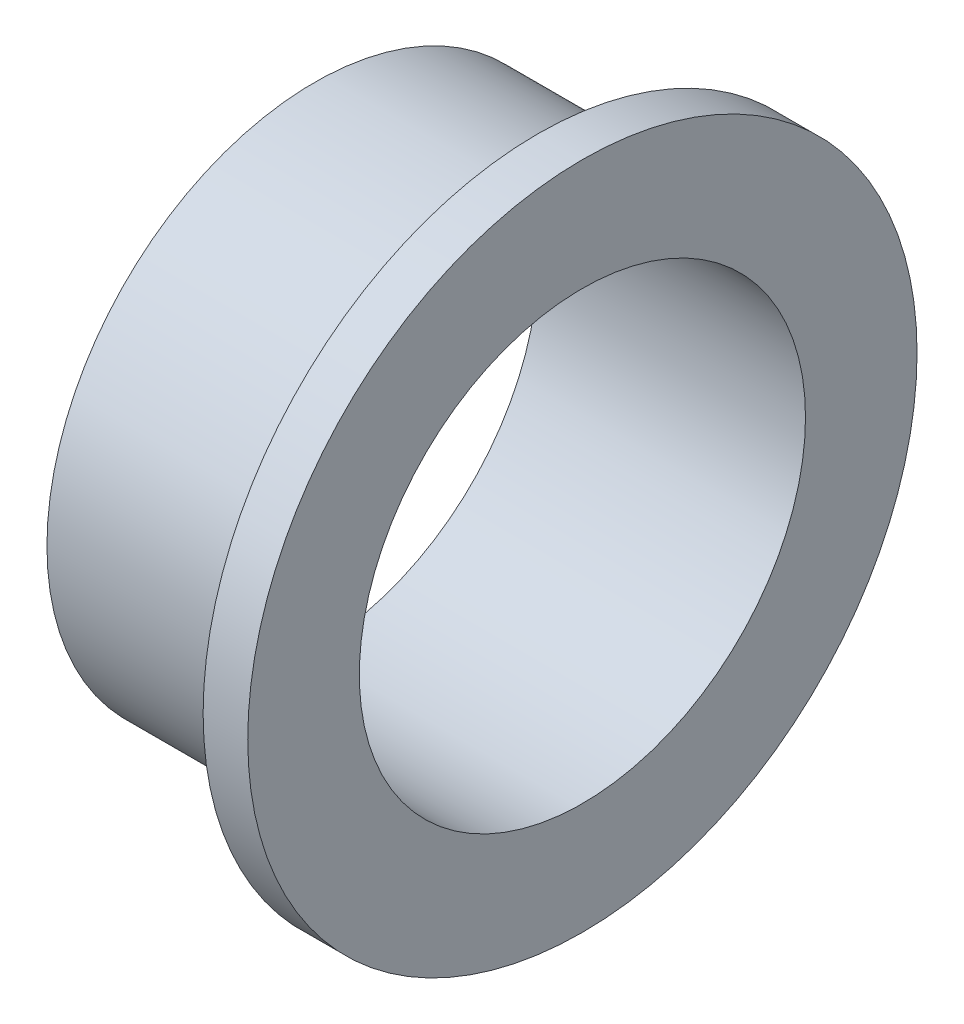
ISO-10303-21;
HEADER;
FILE_DESCRIPTION(('STEP AP214'),'2;1');
FILE_NAME('part.step','',(''),(''),'','','');
FILE_SCHEMA(('AUTOMOTIVE_DESIGN { 1 0 10303 214 1 1 1 1 }'));
ENDSEC;
DATA;
#1=APPLICATION_CONTEXT('core data for automotive mechanical design processes');
#2=APPLICATION_PROTOCOL_DEFINITION('international standard','automotive_design',2000,#1);
#3=PRODUCT_CONTEXT('',#1,'mechanical');
#4=PRODUCT('Part','Part','',(#3));
#5=PRODUCT_RELATED_PRODUCT_CATEGORY('part','',(#4));
#6=PRODUCT_DEFINITION_FORMATION('','',#4);
#7=PRODUCT_DEFINITION_CONTEXT('part definition',#1,'design');
#8=PRODUCT_DEFINITION('design','',#6,#7);
#9=PRODUCT_DEFINITION_SHAPE('','',#8);
#10=(LENGTH_UNIT() NAMED_UNIT(*) SI_UNIT(.MILLI.,.METRE.));
#11=(NAMED_UNIT(*) PLANE_ANGLE_UNIT() SI_UNIT($,.RADIAN.));
#12=(NAMED_UNIT(*) SI_UNIT($,.STERADIAN.) SOLID_ANGLE_UNIT());
#13=UNCERTAINTY_MEASURE_WITH_UNIT(LENGTH_MEASURE(1.E-05),#10,'distance_accuracy_value','');
#14=(GEOMETRIC_REPRESENTATION_CONTEXT(3) GLOBAL_UNCERTAINTY_ASSIGNED_CONTEXT((#13)) GLOBAL_UNIT_ASSIGNED_CONTEXT((#10,
#11,#12)) REPRESENTATION_CONTEXT('',''));
#15=CARTESIAN_POINT('',(0.,0.,0.));
#16=DIRECTION('',(0.,0.,1.));
#17=DIRECTION('',(1.,0.,0.));
#18=AXIS2_PLACEMENT_3D('',#15,#16,#17);
#19=CARTESIAN_POINT('',(-5.99999999999999,6.,0.));
#20=DIRECTION('',(-1.,0.,0.));
#21=DIRECTION('',(0.,0.,1.));
#22=AXIS2_PLACEMENT_3D('',#19,#20,#21);
#23=PLANE('',#22);
#24=CARTESIAN_POINT('',(-5.99999999999999,0.,0.));
#25=DIRECTION('',(1.,0.,0.));
#26=DIRECTION('',(0.,0.,-1.));
#27=AXIS2_PLACEMENT_3D('',#24,#25,#26);
#28=CIRCLE('',#27,4.99999999999999);
#29=CARTESIAN_POINT('',(-5.99999999999999,0.,-4.99999999999999));
#30=VERTEX_POINT('',#29);
#31=EDGE_CURVE('E10',#30,#30,#28,.T.);
#32=ORIENTED_EDGE('',*,*,#31,.T.);
#33=EDGE_LOOP('',(#32));
#34=FACE_BOUND('',#33,.T.);
#35=CARTESIAN_POINT('',(-5.99999999999999,0.,0.));
#36=DIRECTION('',(1.,0.,0.));
#37=DIRECTION('',(0.,0.,-1.));
#38=AXIS2_PLACEMENT_3D('',#35,#36,#37);
#39=CIRCLE('',#38,6.);
#40=CARTESIAN_POINT('',(-5.99999999999999,0.,-6.));
#41=VERTEX_POINT('',#40);
#42=EDGE_CURVE('E53',#41,#41,#39,.T.);
#43=ORIENTED_EDGE('',*,*,#42,.F.);
#44=EDGE_LOOP('',(#43));
#45=FACE_BOUND('',#44,.T.);
#46=ADVANCED_FACE('F31',(#34,#45),#23,.T.);
#47=CARTESIAN_POINT('',(-6.67645776357648,0.,0.));
#48=DIRECTION('',(1.,0.,0.));
#49=DIRECTION('',(0.,0.,-1.));
#50=AXIS2_PLACEMENT_3D('',#47,#48,#49);
#51=CYLINDRICAL_SURFACE('',#50,4.99999999999999);
#52=CARTESIAN_POINT('',(0.,0.,0.));
#53=DIRECTION('',(1.,0.,0.));
#54=DIRECTION('',(0.,0.,-1.));
#55=AXIS2_PLACEMENT_3D('',#52,#53,#54);
#56=CIRCLE('',#55,4.99999999999999);
#57=CARTESIAN_POINT('',(0.,0.,-4.99999999999999));
#58=VERTEX_POINT('',#57);
#59=EDGE_CURVE('E37',#58,#58,#56,.T.);
#60=ORIENTED_EDGE('',*,*,#59,.T.);
#61=EDGE_LOOP('',(#60));
#62=FACE_BOUND('',#61,.T.);
#63=ORIENTED_EDGE('',*,*,#31,.F.);
#64=EDGE_LOOP('',(#63));
#65=FACE_BOUND('',#64,.T.);
#66=ADVANCED_FACE('F61',(#62,#65),#51,.F.);
#67=CARTESIAN_POINT('',(0.,4.99999999999999,0.));
#68=DIRECTION('',(1.,0.,0.));
#69=DIRECTION('',(0.,0.,-1.));
#70=AXIS2_PLACEMENT_3D('',#67,#68,#69);
#71=PLANE('',#70);
#72=CARTESIAN_POINT('',(0.,0.,0.));
#73=DIRECTION('',(1.,0.,0.));
#74=DIRECTION('',(0.,0.,-1.));
#75=AXIS2_PLACEMENT_3D('',#72,#73,#74);
#76=CIRCLE('',#75,7.5);
#77=CARTESIAN_POINT('',(0.,0.,-7.5));
#78=VERTEX_POINT('',#77);
#79=EDGE_CURVE('E41',#78,#78,#76,.T.);
#80=ORIENTED_EDGE('',*,*,#79,.T.);
#81=EDGE_LOOP('',(#80));
#82=FACE_BOUND('',#81,.T.);
#83=ORIENTED_EDGE('',*,*,#59,.F.);
#84=EDGE_LOOP('',(#83));
#85=FACE_BOUND('',#84,.T.);
#86=ADVANCED_FACE('F65',(#82,#85),#71,.T.);
#87=CARTESIAN_POINT('',(-6.67645776357648,0.,0.));
#88=DIRECTION('',(1.,0.,0.));
#89=DIRECTION('',(0.,0.,-1.));
#90=AXIS2_PLACEMENT_3D('',#87,#88,#89);
#91=CYLINDRICAL_SURFACE('',#90,7.5);
#92=CARTESIAN_POINT('',(-1.,0.,0.));
#93=DIRECTION('',(1.,0.,0.));
#94=DIRECTION('',(0.,0.,-1.));
#95=AXIS2_PLACEMENT_3D('',#92,#93,#94);
#96=CIRCLE('',#95,7.5);
#97=CARTESIAN_POINT('',(-1.,0.,-7.5));
#98=VERTEX_POINT('',#97);
#99=EDGE_CURVE('E45',#98,#98,#96,.T.);
#100=ORIENTED_EDGE('',*,*,#99,.T.);
#101=EDGE_LOOP('',(#100));
#102=FACE_BOUND('',#101,.T.);
#103=ORIENTED_EDGE('',*,*,#79,.F.);
#104=EDGE_LOOP('',(#103));
#105=FACE_BOUND('',#104,.T.);
#106=ADVANCED_FACE('F69',(#102,#105),#91,.T.);
#107=CARTESIAN_POINT('',(-0.999999999999997,7.5,0.));
#108=DIRECTION('',(-1.,0.,0.));
#109=DIRECTION('',(0.,0.,1.));
#110=AXIS2_PLACEMENT_3D('',#107,#108,#109);
#111=PLANE('',#110);
#112=CARTESIAN_POINT('',(-0.999999999999994,0.,0.));
#113=DIRECTION('',(1.,0.,0.));
#114=DIRECTION('',(0.,0.,-1.));
#115=AXIS2_PLACEMENT_3D('',#112,#113,#114);
#116=CIRCLE('',#115,6.);
#117=CARTESIAN_POINT('',(-0.999999999999994,0.,-6.));
#118=VERTEX_POINT('',#117);
#119=EDGE_CURVE('E50',#118,#118,#116,.T.);
#120=ORIENTED_EDGE('',*,*,#119,.T.);
#121=EDGE_LOOP('',(#120));
#122=FACE_BOUND('',#121,.T.);
#123=ORIENTED_EDGE('',*,*,#99,.F.);
#124=EDGE_LOOP('',(#123));
#125=FACE_BOUND('',#124,.T.);
#126=ADVANCED_FACE('F76',(#122,#125),#111,.T.);
#127=CARTESIAN_POINT('',(-6.67645776357648,0.,0.));
#128=DIRECTION('',(1.,0.,0.));
#129=DIRECTION('',(0.,0.,-1.));
#130=AXIS2_PLACEMENT_3D('',#127,#128,#129);
#131=CYLINDRICAL_SURFACE('',#130,6.);
#132=ORIENTED_EDGE('',*,*,#42,.T.);
#133=EDGE_LOOP('',(#132));
#134=FACE_BOUND('',#133,.T.);
#135=ORIENTED_EDGE('',*,*,#119,.F.);
#136=EDGE_LOOP('',(#135));
#137=FACE_BOUND('',#136,.T.);
#138=ADVANCED_FACE('F57',(#134,#137),#131,.T.);
#139=CLOSED_SHELL('',(#46,#66,#86,#106,#126,#138));
#140=MANIFOLD_SOLID_BREP('B2',#139);
#141=ADVANCED_BREP_SHAPE_REPRESENTATION('',(#18,#140),#14);
#142=SHAPE_DEFINITION_REPRESENTATION(#9,#141);
ENDSEC;
END-ISO-10303-21;
